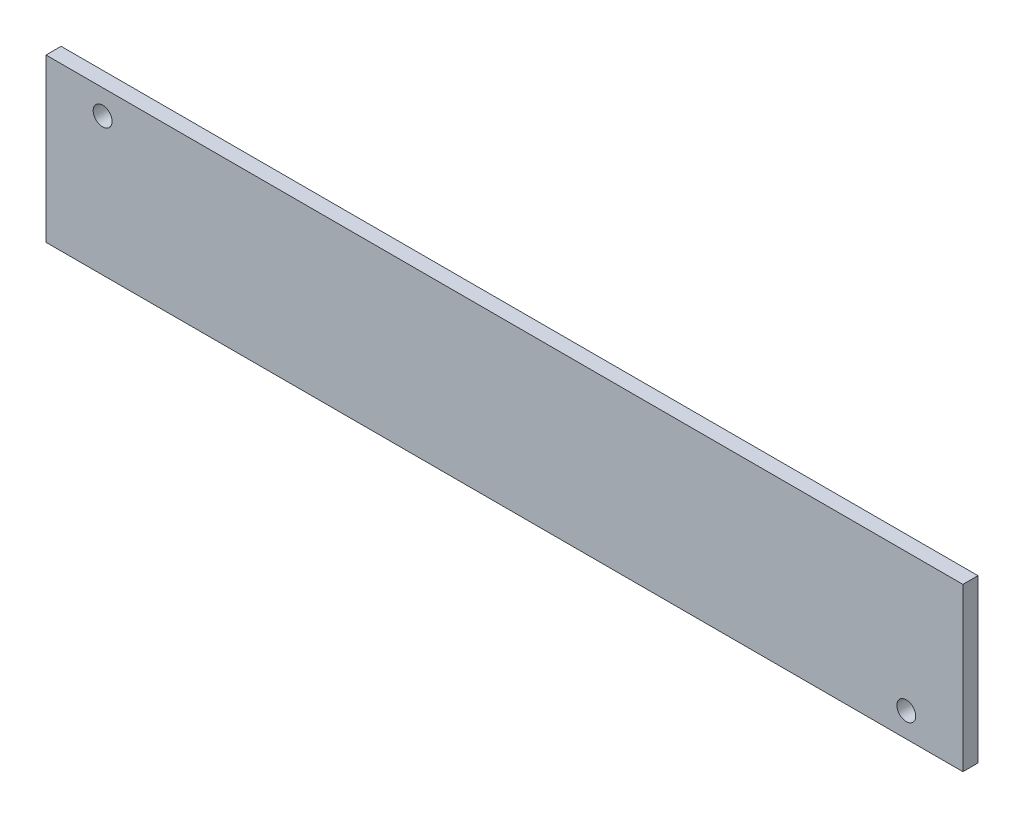
ISO-10303-21;
HEADER;
FILE_DESCRIPTION(('STEP AP214'),'2;1');
FILE_NAME('part.step','',(''),(''),'','','');
FILE_SCHEMA(('AUTOMOTIVE_DESIGN { 1 0 10303 214 1 1 1 1 }'));
ENDSEC;
DATA;
#1=APPLICATION_CONTEXT('core data for automotive mechanical design processes');
#2=APPLICATION_PROTOCOL_DEFINITION('international standard','automotive_design',2000,#1);
#3=PRODUCT_CONTEXT('',#1,'mechanical');
#4=PRODUCT('Part','Part','',(#3));
#5=PRODUCT_RELATED_PRODUCT_CATEGORY('part','',(#4));
#6=PRODUCT_DEFINITION_FORMATION('','',#4);
#7=PRODUCT_DEFINITION_CONTEXT('part definition',#1,'design');
#8=PRODUCT_DEFINITION('design','',#6,#7);
#9=PRODUCT_DEFINITION_SHAPE('','',#8);
#10=(LENGTH_UNIT() NAMED_UNIT(*) SI_UNIT(.MILLI.,.METRE.));
#11=(NAMED_UNIT(*) PLANE_ANGLE_UNIT() SI_UNIT($,.RADIAN.));
#12=(NAMED_UNIT(*) SI_UNIT($,.STERADIAN.) SOLID_ANGLE_UNIT());
#13=UNCERTAINTY_MEASURE_WITH_UNIT(LENGTH_MEASURE(1.E-05),#10,'distance_accuracy_value','');
#14=(GEOMETRIC_REPRESENTATION_CONTEXT(3) GLOBAL_UNCERTAINTY_ASSIGNED_CONTEXT((#13)) GLOBAL_UNIT_ASSIGNED_CONTEXT((#10,
#11,#12)) REPRESENTATION_CONTEXT('',''));
#15=CARTESIAN_POINT('',(0.,0.,0.));
#16=DIRECTION('',(0.,0.,1.));
#17=DIRECTION('',(1.,0.,0.));
#18=AXIS2_PLACEMENT_3D('',#15,#16,#17);
#19=CARTESIAN_POINT('',(-60.75,10.75,2.));
#20=DIRECTION('',(1.,0.,0.));
#21=DIRECTION('',(0.,0.,-1.));
#22=AXIS2_PLACEMENT_3D('',#19,#20,#21);
#23=PLANE('',#22);
#24=DIRECTION('',(0.,-1.,0.));
#25=VECTOR('',#24,1.);
#26=CARTESIAN_POINT('',(-60.75,10.75,0.));
#27=LINE('',#26,#25);
#28=CARTESIAN_POINT('',(-60.75,10.75,0.));
#29=VERTEX_POINT('',#28);
#30=CARTESIAN_POINT('',(-60.75,-10.75,0.));
#31=VERTEX_POINT('',#30);
#32=EDGE_CURVE('E118',#29,#31,#27,.T.);
#33=ORIENTED_EDGE('',*,*,#32,.T.);
#34=DIRECTION('',(0.,0.,-1.));
#35=VECTOR('',#34,1.);
#36=CARTESIAN_POINT('',(-60.75,-10.75,2.));
#37=LINE('',#36,#35);
#38=CARTESIAN_POINT('',(-60.75,-10.75,2.));
#39=VERTEX_POINT('',#38);
#40=EDGE_CURVE('E11',#39,#31,#37,.T.);
#41=ORIENTED_EDGE('',*,*,#40,.F.);
#42=DIRECTION('',(0.,-1.,0.));
#43=VECTOR('',#42,1.);
#44=CARTESIAN_POINT('',(-60.75,10.75,2.));
#45=LINE('',#44,#43);
#46=CARTESIAN_POINT('',(-60.75,10.75,2.));
#47=VERTEX_POINT('',#46);
#48=EDGE_CURVE('E100',#47,#39,#45,.T.);
#49=ORIENTED_EDGE('',*,*,#48,.F.);
#50=DIRECTION('',(0.,0.,-1.));
#51=VECTOR('',#50,1.);
#52=CARTESIAN_POINT('',(-60.75,10.75,2.));
#53=LINE('',#52,#51);
#54=EDGE_CURVE('E114',#47,#29,#53,.T.);
#55=ORIENTED_EDGE('',*,*,#54,.T.);
#56=EDGE_LOOP('',(#33,#41,#49,#55));
#57=FACE_BOUND('',#56,.T.);
#58=ADVANCED_FACE('F48',(#57),#23,.F.);
#59=CARTESIAN_POINT('',(-60.75,-10.75,2.));
#60=DIRECTION('',(0.,1.,0.));
#61=DIRECTION('',(0.,0.,1.));
#62=AXIS2_PLACEMENT_3D('',#59,#60,#61);
#63=PLANE('',#62);
#64=DIRECTION('',(1.,0.,0.));
#65=VECTOR('',#64,1.);
#66=CARTESIAN_POINT('',(-60.75,-10.75,0.));
#67=LINE('',#66,#65);
#68=CARTESIAN_POINT('',(60.75,-10.75,0.));
#69=VERTEX_POINT('',#68);
#70=EDGE_CURVE('E105',#31,#69,#67,.T.);
#71=ORIENTED_EDGE('',*,*,#70,.T.);
#72=DIRECTION('',(0.,0.,-1.));
#73=VECTOR('',#72,1.);
#74=CARTESIAN_POINT('',(60.75,-10.75,2.));
#75=LINE('',#74,#73);
#76=CARTESIAN_POINT('',(60.75,-10.75,2.));
#77=VERTEX_POINT('',#76);
#78=EDGE_CURVE('E57',#77,#69,#75,.T.);
#79=ORIENTED_EDGE('',*,*,#78,.F.);
#80=DIRECTION('',(1.,0.,0.));
#81=VECTOR('',#80,1.);
#82=CARTESIAN_POINT('',(-60.75,-10.75,2.));
#83=LINE('',#82,#81);
#84=EDGE_CURVE('E95',#39,#77,#83,.T.);
#85=ORIENTED_EDGE('',*,*,#84,.F.);
#86=ORIENTED_EDGE('',*,*,#40,.T.);
#87=EDGE_LOOP('',(#71,#79,#85,#86));
#88=FACE_BOUND('',#87,.T.);
#89=ADVANCED_FACE('F104',(#88),#63,.F.);
#90=CARTESIAN_POINT('',(60.75,10.75,2.));
#91=DIRECTION('',(-1.,0.,0.));
#92=DIRECTION('',(0.,-1.,0.));
#93=AXIS2_PLACEMENT_3D('',#90,#91,#92);
#94=PLANE('',#93);
#95=DIRECTION('',(0.,1.,0.));
#96=VECTOR('',#95,1.);
#97=CARTESIAN_POINT('',(60.75,10.75,0.));
#98=LINE('',#97,#96);
#99=CARTESIAN_POINT('',(60.75,10.75,0.));
#100=VERTEX_POINT('',#99);
#101=EDGE_CURVE('E82',#69,#100,#98,.T.);
#102=ORIENTED_EDGE('',*,*,#101,.T.);
#103=DIRECTION('',(0.,0.,-1.));
#104=VECTOR('',#103,1.);
#105=CARTESIAN_POINT('',(60.75,10.75,2.));
#106=LINE('',#105,#104);
#107=CARTESIAN_POINT('',(60.75,10.75,2.));
#108=VERTEX_POINT('',#107);
#109=EDGE_CURVE('E107',#108,#100,#106,.T.);
#110=ORIENTED_EDGE('',*,*,#109,.F.);
#111=DIRECTION('',(0.,1.,0.));
#112=VECTOR('',#111,1.);
#113=CARTESIAN_POINT('',(60.75,10.75,2.));
#114=LINE('',#113,#112);
#115=EDGE_CURVE('E98',#77,#108,#114,.T.);
#116=ORIENTED_EDGE('',*,*,#115,.F.);
#117=ORIENTED_EDGE('',*,*,#78,.T.);
#118=EDGE_LOOP('',(#102,#110,#116,#117));
#119=FACE_BOUND('',#118,.T.);
#120=ADVANCED_FACE('F108',(#119),#94,.F.);
#121=CARTESIAN_POINT('',(-60.75,10.75,2.));
#122=DIRECTION('',(0.,-1.,0.));
#123=DIRECTION('',(0.,0.,-1.));
#124=AXIS2_PLACEMENT_3D('',#121,#122,#123);
#125=PLANE('',#124);
#126=DIRECTION('',(-1.,0.,0.));
#127=VECTOR('',#126,1.);
#128=CARTESIAN_POINT('',(-60.75,10.75,0.));
#129=LINE('',#128,#127);
#130=EDGE_CURVE('E88',#100,#29,#129,.T.);
#131=ORIENTED_EDGE('',*,*,#130,.T.);
#132=ORIENTED_EDGE('',*,*,#54,.F.);
#133=DIRECTION('',(-1.,0.,0.));
#134=VECTOR('',#133,1.);
#135=CARTESIAN_POINT('',(-60.75,10.75,2.));
#136=LINE('',#135,#134);
#137=EDGE_CURVE('E65',#108,#47,#136,.T.);
#138=ORIENTED_EDGE('',*,*,#137,.F.);
#139=ORIENTED_EDGE('',*,*,#109,.T.);
#140=EDGE_LOOP('',(#131,#132,#138,#139));
#141=FACE_BOUND('',#140,.T.);
#142=ADVANCED_FACE('F134',(#141),#125,.F.);
#143=CARTESIAN_POINT('',(0.,0.,2.));
#144=DIRECTION('',(0.,0.,1.));
#145=DIRECTION('',(1.,0.,0.));
#146=AXIS2_PLACEMENT_3D('',#143,#144,#145);
#147=PLANE('',#146);
#148=CARTESIAN_POINT('',(-53.25,7.50000000000001,2.));
#149=DIRECTION('',(0.,0.,1.));
#150=DIRECTION('',(1.,0.,0.));
#151=AXIS2_PLACEMENT_3D('',#148,#149,#150);
#152=CIRCLE('',#151,1.25);
#153=CARTESIAN_POINT('',(-52.,7.50000000000001,2.));
#154=VERTEX_POINT('',#153);
#155=EDGE_CURVE('E151',#154,#154,#152,.T.);
#156=ORIENTED_EDGE('',*,*,#155,.F.);
#157=EDGE_LOOP('',(#156));
#158=FACE_BOUND('',#157,.T.);
#159=CARTESIAN_POINT('',(53.25,-7.50000000000001,2.));
#160=DIRECTION('',(0.,0.,1.));
#161=DIRECTION('',(1.,0.,0.));
#162=AXIS2_PLACEMENT_3D('',#159,#160,#161);
#163=CIRCLE('',#162,1.25);
#164=CARTESIAN_POINT('',(54.5,-7.50000000000001,2.));
#165=VERTEX_POINT('',#164);
#166=EDGE_CURVE('E147',#165,#165,#163,.T.);
#167=ORIENTED_EDGE('',*,*,#166,.F.);
#168=EDGE_LOOP('',(#167));
#169=FACE_BOUND('',#168,.T.);
#170=ORIENTED_EDGE('',*,*,#48,.T.);
#171=ORIENTED_EDGE('',*,*,#84,.T.);
#172=ORIENTED_EDGE('',*,*,#115,.T.);
#173=ORIENTED_EDGE('',*,*,#137,.T.);
#174=EDGE_LOOP('',(#170,#171,#172,#173));
#175=FACE_BOUND('',#174,.T.);
#176=ADVANCED_FACE('F96',(#158,#169,#175),#147,.T.);
#177=CARTESIAN_POINT('',(0.,0.,0.));
#178=DIRECTION('',(0.,0.,1.));
#179=DIRECTION('',(1.,0.,0.));
#180=AXIS2_PLACEMENT_3D('',#177,#178,#179);
#181=PLANE('',#180);
#182=CARTESIAN_POINT('',(-53.25,7.50000000000001,0.));
#183=DIRECTION('',(0.,0.,1.));
#184=DIRECTION('',(1.,0.,0.));
#185=AXIS2_PLACEMENT_3D('',#182,#183,#184);
#186=CIRCLE('',#185,1.25);
#187=CARTESIAN_POINT('',(-52.,7.50000000000001,0.));
#188=VERTEX_POINT('',#187);
#189=EDGE_CURVE('E122',#188,#188,#186,.T.);
#190=ORIENTED_EDGE('',*,*,#189,.T.);
#191=EDGE_LOOP('',(#190));
#192=FACE_BOUND('',#191,.T.);
#193=CARTESIAN_POINT('',(53.25,-7.50000000000001,0.));
#194=DIRECTION('',(0.,0.,1.));
#195=DIRECTION('',(1.,0.,0.));
#196=AXIS2_PLACEMENT_3D('',#193,#194,#195);
#197=CIRCLE('',#196,1.25);
#198=CARTESIAN_POINT('',(54.5,-7.50000000000001,0.));
#199=VERTEX_POINT('',#198);
#200=EDGE_CURVE('E143',#199,#199,#197,.T.);
#201=ORIENTED_EDGE('',*,*,#200,.T.);
#202=EDGE_LOOP('',(#201));
#203=FACE_BOUND('',#202,.T.);
#204=ORIENTED_EDGE('',*,*,#32,.F.);
#205=ORIENTED_EDGE('',*,*,#130,.F.);
#206=ORIENTED_EDGE('',*,*,#101,.F.);
#207=ORIENTED_EDGE('',*,*,#70,.F.);
#208=EDGE_LOOP('',(#204,#205,#206,#207));
#209=FACE_BOUND('',#208,.T.);
#210=ADVANCED_FACE('F137',(#192,#203,#209),#181,.F.);
#211=CARTESIAN_POINT('',(53.25,-7.50000000000001,0.));
#212=DIRECTION('',(0.,0.,1.));
#213=DIRECTION('',(1.,0.,0.));
#214=AXIS2_PLACEMENT_3D('',#211,#212,#213);
#215=CYLINDRICAL_SURFACE('',#214,1.25);
#216=ORIENTED_EDGE('',*,*,#200,.F.);
#217=EDGE_LOOP('',(#216));
#218=FACE_BOUND('',#217,.T.);
#219=ORIENTED_EDGE('',*,*,#166,.T.);
#220=EDGE_LOOP('',(#219));
#221=FACE_BOUND('',#220,.T.);
#222=ADVANCED_FACE('F166',(#218,#221),#215,.F.);
#223=CARTESIAN_POINT('',(-53.25,7.50000000000001,0.));
#224=DIRECTION('',(0.,0.,1.));
#225=DIRECTION('',(1.,0.,0.));
#226=AXIS2_PLACEMENT_3D('',#223,#224,#225);
#227=CYLINDRICAL_SURFACE('',#226,1.25);
#228=ORIENTED_EDGE('',*,*,#189,.F.);
#229=EDGE_LOOP('',(#228));
#230=FACE_BOUND('',#229,.T.);
#231=ORIENTED_EDGE('',*,*,#155,.T.);
#232=EDGE_LOOP('',(#231));
#233=FACE_BOUND('',#232,.T.);
#234=ADVANCED_FACE('F163',(#230,#233),#227,.F.);
#235=CLOSED_SHELL('',(#58,#89,#120,#142,#176,#210,#222,#234));
#236=MANIFOLD_SOLID_BREP('B2',#235);
#237=ADVANCED_BREP_SHAPE_REPRESENTATION('',(#18,#236),#14);
#238=SHAPE_DEFINITION_REPRESENTATION(#9,#237);
ENDSEC;
END-ISO-10303-21;
